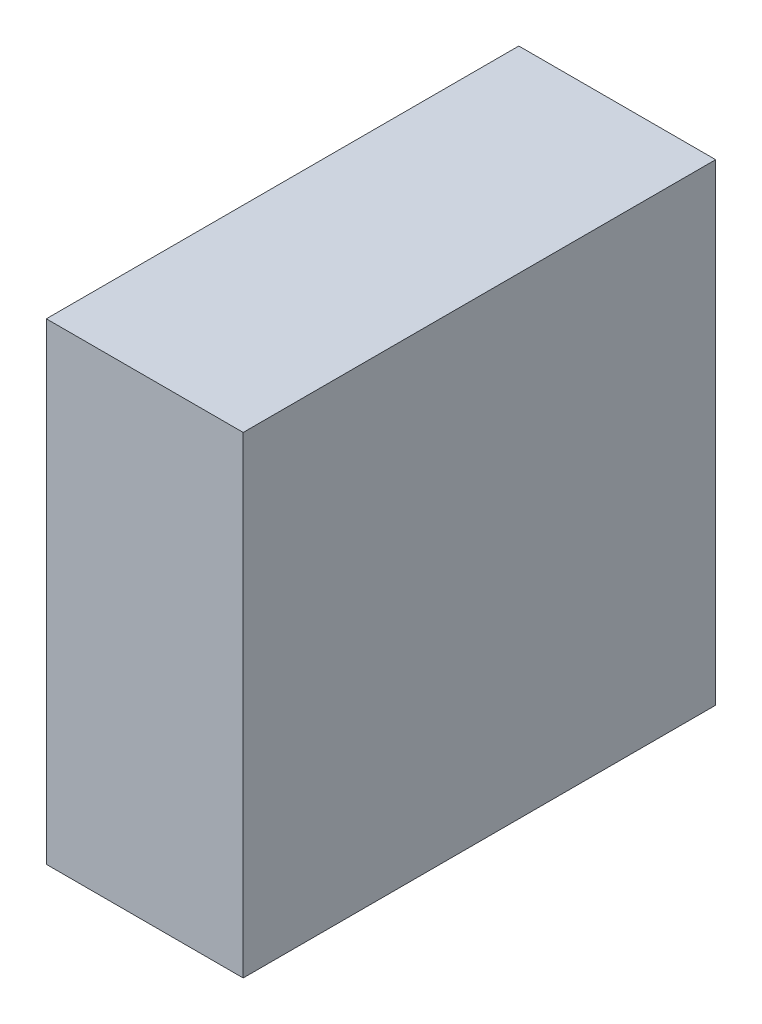
ISO-10303-21;
HEADER;
FILE_DESCRIPTION(('STEP AP214'),'2;1');
FILE_NAME('part.step','',(''),(''),'','','');
FILE_SCHEMA(('AUTOMOTIVE_DESIGN { 1 0 10303 214 1 1 1 1 }'));
ENDSEC;
DATA;
#1=APPLICATION_CONTEXT('core data for automotive mechanical design processes');
#2=APPLICATION_PROTOCOL_DEFINITION('international standard','automotive_design',2000,#1);
#3=PRODUCT_CONTEXT('',#1,'mechanical');
#4=PRODUCT('Part','Part','',(#3));
#5=PRODUCT_RELATED_PRODUCT_CATEGORY('part','',(#4));
#6=PRODUCT_DEFINITION_FORMATION('','',#4);
#7=PRODUCT_DEFINITION_CONTEXT('part definition',#1,'design');
#8=PRODUCT_DEFINITION('design','',#6,#7);
#9=PRODUCT_DEFINITION_SHAPE('','',#8);
#10=(LENGTH_UNIT() NAMED_UNIT(*) SI_UNIT(.MILLI.,.METRE.));
#11=(NAMED_UNIT(*) PLANE_ANGLE_UNIT() SI_UNIT($,.RADIAN.));
#12=(NAMED_UNIT(*) SI_UNIT($,.STERADIAN.) SOLID_ANGLE_UNIT());
#13=UNCERTAINTY_MEASURE_WITH_UNIT(LENGTH_MEASURE(1.E-05),#10,'distance_accuracy_value','');
#14=(GEOMETRIC_REPRESENTATION_CONTEXT(3) GLOBAL_UNCERTAINTY_ASSIGNED_CONTEXT((#13)) GLOBAL_UNIT_ASSIGNED_CONTEXT((#10,
#11,#12)) REPRESENTATION_CONTEXT('',''));
#15=CARTESIAN_POINT('',(0.,0.,0.));
#16=DIRECTION('',(0.,0.,1.));
#17=DIRECTION('',(1.,0.,0.));
#18=AXIS2_PLACEMENT_3D('',#15,#16,#17);
#19=CARTESIAN_POINT('',(0.12500102,-0.2999994,0.));
#20=DIRECTION('',(-1.,0.,0.));
#21=DIRECTION('',(0.,0.,1.));
#22=AXIS2_PLACEMENT_3D('',#19,#20,#21);
#23=PLANE('',#22);
#24=DIRECTION('',(0.,0.,-1.));
#25=VECTOR('',#24,1.);
#26=CARTESIAN_POINT('',(0.12500102,0.2999994,0.));
#27=LINE('',#26,#25);
#28=CARTESIAN_POINT('',(0.12500102,0.2999994,0.));
#29=VERTEX_POINT('',#28);
#30=CARTESIAN_POINT('',(0.12500102,0.2999994,0.5999988));
#31=VERTEX_POINT('',#30);
#32=EDGE_CURVE('E20',#29,#31,#27,.F.);
#33=ORIENTED_EDGE('',*,*,#32,.T.);
#34=DIRECTION('',(0.,1.,0.));
#35=VECTOR('',#34,1.);
#36=CARTESIAN_POINT('',(0.12500102,0.2999994,0.5999988));
#37=LINE('',#36,#35);
#38=CARTESIAN_POINT('',(0.12500102,-0.2999994,0.5999988));
#39=VERTEX_POINT('',#38);
#40=EDGE_CURVE('E55',#31,#39,#37,.F.);
#41=ORIENTED_EDGE('',*,*,#40,.T.);
#42=DIRECTION('',(0.,0.,1.));
#43=VECTOR('',#42,1.);
#44=CARTESIAN_POINT('',(0.12500102,-0.2999994,0.));
#45=LINE('',#44,#43);
#46=CARTESIAN_POINT('',(0.12500102,-0.2999994,0.));
#47=VERTEX_POINT('',#46);
#48=EDGE_CURVE('E76',#39,#47,#45,.F.);
#49=ORIENTED_EDGE('',*,*,#48,.T.);
#50=DIRECTION('',(0.,1.,0.));
#51=VECTOR('',#50,1.);
#52=CARTESIAN_POINT('',(0.12500102,0.2999994,0.));
#53=LINE('',#52,#51);
#54=EDGE_CURVE('E58',#29,#47,#53,.F.);
#55=ORIENTED_EDGE('',*,*,#54,.F.);
#56=EDGE_LOOP('',(#33,#41,#49,#55));
#57=FACE_BOUND('',#56,.T.);
#58=ADVANCED_FACE('F17',(#57),#23,.F.);
#59=CARTESIAN_POINT('',(0.12500102,0.2999994,0.));
#60=DIRECTION('',(0.,-1.,0.));
#61=DIRECTION('',(0.,0.,-1.));
#62=AXIS2_PLACEMENT_3D('',#59,#60,#61);
#63=PLANE('',#62);
#64=DIRECTION('',(0.,0.,-1.));
#65=VECTOR('',#64,1.);
#66=CARTESIAN_POINT('',(-0.12499848,0.2999994,0.));
#67=LINE('',#66,#65);
#68=CARTESIAN_POINT('',(-0.12499848,0.2999994,0.));
#69=VERTEX_POINT('',#68);
#70=CARTESIAN_POINT('',(-0.12499848,0.2999994,0.5999988));
#71=VERTEX_POINT('',#70);
#72=EDGE_CURVE('E73',#69,#71,#67,.F.);
#73=ORIENTED_EDGE('',*,*,#72,.T.);
#74=DIRECTION('',(-1.,0.,0.));
#75=VECTOR('',#74,1.);
#76=CARTESIAN_POINT('',(-0.12499848,0.2999994,0.5999988));
#77=LINE('',#76,#75);
#78=EDGE_CURVE('E63',#71,#31,#77,.F.);
#79=ORIENTED_EDGE('',*,*,#78,.T.);
#80=ORIENTED_EDGE('',*,*,#32,.F.);
#81=DIRECTION('',(-1.,0.,0.));
#82=VECTOR('',#81,1.);
#83=CARTESIAN_POINT('',(-0.12499848,0.2999994,0.));
#84=LINE('',#83,#82);
#85=EDGE_CURVE('E78',#69,#29,#84,.F.);
#86=ORIENTED_EDGE('',*,*,#85,.F.);
#87=EDGE_LOOP('',(#73,#79,#80,#86));
#88=FACE_BOUND('',#87,.T.);
#89=ADVANCED_FACE('F72',(#88),#63,.F.);
#90=CARTESIAN_POINT('',(-0.12499848,0.2999994,0.5999988));
#91=DIRECTION('',(0.,0.,-1.));
#92=DIRECTION('',(-1.,0.,0.));
#93=AXIS2_PLACEMENT_3D('',#90,#91,#92);
#94=PLANE('',#93);
#95=DIRECTION('',(1.,0.,0.));
#96=VECTOR('',#95,1.);
#97=CARTESIAN_POINT('',(-0.12499848,-0.2999994,0.5999988));
#98=LINE('',#97,#96);
#99=CARTESIAN_POINT('',(-0.12499848,-0.2999994,0.5999988));
#100=VERTEX_POINT('',#99);
#101=EDGE_CURVE('E69',#100,#39,#98,.T.);
#102=ORIENTED_EDGE('',*,*,#101,.T.);
#103=ORIENTED_EDGE('',*,*,#40,.F.);
#104=ORIENTED_EDGE('',*,*,#78,.F.);
#105=DIRECTION('',(0.,1.,0.));
#106=VECTOR('',#105,1.);
#107=CARTESIAN_POINT('',(-0.12499848,0.2999994,0.5999988));
#108=LINE('',#107,#106);
#109=EDGE_CURVE('E83',#71,#100,#108,.F.);
#110=ORIENTED_EDGE('',*,*,#109,.T.);
#111=EDGE_LOOP('',(#102,#103,#104,#110));
#112=FACE_BOUND('',#111,.T.);
#113=ADVANCED_FACE('F66',(#112),#94,.F.);
#114=CARTESIAN_POINT('',(-0.12499848,-0.2999994,0.));
#115=DIRECTION('',(0.,1.,0.));
#116=DIRECTION('',(0.,0.,1.));
#117=AXIS2_PLACEMENT_3D('',#114,#115,#116);
#118=PLANE('',#117);
#119=ORIENTED_EDGE('',*,*,#48,.F.);
#120=ORIENTED_EDGE('',*,*,#101,.F.);
#121=DIRECTION('',(0.,0.,-1.));
#122=VECTOR('',#121,1.);
#123=CARTESIAN_POINT('',(-0.12499848,-0.2999994,0.));
#124=LINE('',#123,#122);
#125=CARTESIAN_POINT('',(-0.12499848,-0.2999994,0.));
#126=VERTEX_POINT('',#125);
#127=EDGE_CURVE('E26',#100,#126,#124,.T.);
#128=ORIENTED_EDGE('',*,*,#127,.T.);
#129=DIRECTION('',(-1.,0.,0.));
#130=VECTOR('',#129,1.);
#131=CARTESIAN_POINT('',(-0.12499848,-0.2999994,0.));
#132=LINE('',#131,#130);
#133=EDGE_CURVE('E34',#47,#126,#132,.T.);
#134=ORIENTED_EDGE('',*,*,#133,.F.);
#135=EDGE_LOOP('',(#119,#120,#128,#134));
#136=FACE_BOUND('',#135,.T.);
#137=ADVANCED_FACE('F88',(#136),#118,.F.);
#138=CARTESIAN_POINT('',(-0.12499848,0.2999994,0.));
#139=DIRECTION('',(0.,0.,-1.));
#140=DIRECTION('',(-1.,0.,0.));
#141=AXIS2_PLACEMENT_3D('',#138,#139,#140);
#142=PLANE('',#141);
#143=ORIENTED_EDGE('',*,*,#133,.T.);
#144=DIRECTION('',(0.,1.,0.));
#145=VECTOR('',#144,1.);
#146=CARTESIAN_POINT('',(-0.12499848,0.2999994,0.));
#147=LINE('',#146,#145);
#148=EDGE_CURVE('E11',#126,#69,#147,.T.);
#149=ORIENTED_EDGE('',*,*,#148,.T.);
#150=ORIENTED_EDGE('',*,*,#85,.T.);
#151=ORIENTED_EDGE('',*,*,#54,.T.);
#152=EDGE_LOOP('',(#143,#149,#150,#151));
#153=FACE_BOUND('',#152,.T.);
#154=ADVANCED_FACE('F91',(#153),#142,.T.);
#155=CARTESIAN_POINT('',(-0.12499848,0.2999994,0.));
#156=DIRECTION('',(1.,0.,0.));
#157=DIRECTION('',(0.,0.,-1.));
#158=AXIS2_PLACEMENT_3D('',#155,#156,#157);
#159=PLANE('',#158);
#160=ORIENTED_EDGE('',*,*,#127,.F.);
#161=ORIENTED_EDGE('',*,*,#109,.F.);
#162=ORIENTED_EDGE('',*,*,#72,.F.);
#163=ORIENTED_EDGE('',*,*,#148,.F.);
#164=EDGE_LOOP('',(#160,#161,#162,#163));
#165=FACE_BOUND('',#164,.T.);
#166=ADVANCED_FACE('F90',(#165),#159,.F.);
#167=CLOSED_SHELL('',(#58,#89,#113,#137,#154,#166));
#168=MANIFOLD_SOLID_BREP('B1',#167);
#169=ADVANCED_BREP_SHAPE_REPRESENTATION('',(#18,#168),#14);
#170=SHAPE_DEFINITION_REPRESENTATION(#9,#169);
ENDSEC;
END-ISO-10303-21;
